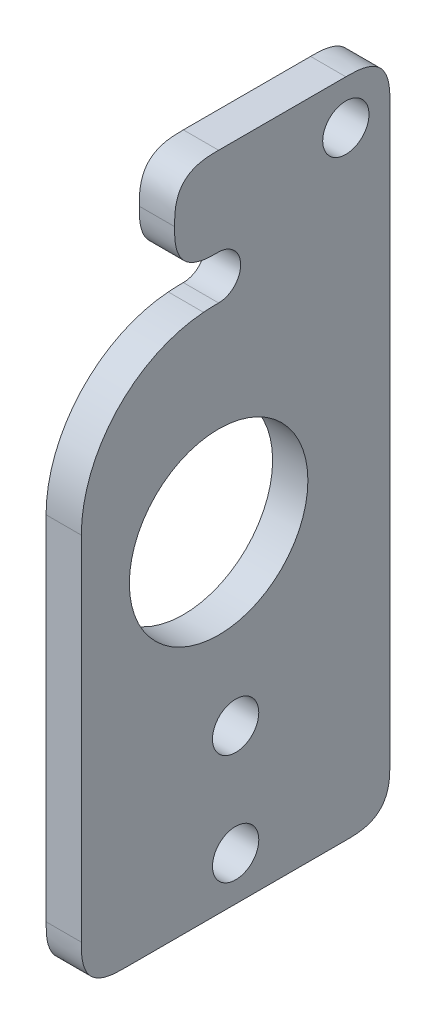
ISO-10303-21;
HEADER;
FILE_DESCRIPTION(('STEP AP214'),'2;1');
FILE_NAME('part.step','',(''),(''),'','','');
FILE_SCHEMA(('AUTOMOTIVE_DESIGN { 1 0 10303 214 1 1 1 1 }'));
ENDSEC;
DATA;
#1=APPLICATION_CONTEXT('core data for automotive mechanical design processes');
#2=APPLICATION_PROTOCOL_DEFINITION('international standard','automotive_design',2000,#1);
#3=PRODUCT_CONTEXT('',#1,'mechanical');
#4=PRODUCT('Part','Part','',(#3));
#5=PRODUCT_RELATED_PRODUCT_CATEGORY('part','',(#4));
#6=PRODUCT_DEFINITION_FORMATION('','',#4);
#7=PRODUCT_DEFINITION_CONTEXT('part definition',#1,'design');
#8=PRODUCT_DEFINITION('design','',#6,#7);
#9=PRODUCT_DEFINITION_SHAPE('','',#8);
#10=(LENGTH_UNIT() NAMED_UNIT(*) SI_UNIT(.MILLI.,.METRE.));
#11=(NAMED_UNIT(*) PLANE_ANGLE_UNIT() SI_UNIT($,.RADIAN.));
#12=(NAMED_UNIT(*) SI_UNIT($,.STERADIAN.) SOLID_ANGLE_UNIT());
#13=UNCERTAINTY_MEASURE_WITH_UNIT(LENGTH_MEASURE(1.E-05),#10,'distance_accuracy_value','');
#14=(GEOMETRIC_REPRESENTATION_CONTEXT(3) GLOBAL_UNCERTAINTY_ASSIGNED_CONTEXT((#13)) GLOBAL_UNIT_ASSIGNED_CONTEXT((#10,
#11,#12)) REPRESENTATION_CONTEXT('',''));
#15=CARTESIAN_POINT('',(0.,0.,0.));
#16=DIRECTION('',(0.,0.,1.));
#17=DIRECTION('',(1.,0.,0.));
#18=AXIS2_PLACEMENT_3D('',#15,#16,#17);
#19=CARTESIAN_POINT('',(-8.00000000000001,-75.0000000000001,-35.));
#20=DIRECTION('',(0.,0.,-1.));
#21=DIRECTION('',(-1.,0.,0.));
#22=AXIS2_PLACEMENT_3D('',#19,#20,#21);
#23=PLANE('',#22);
#24=DIRECTION('',(0.,1.,0.));
#25=VECTOR('',#24,1.);
#26=CARTESIAN_POINT('',(0.,-75.0000000000001,-35.));
#27=LINE('',#26,#25);
#28=CARTESIAN_POINT('',(0.,-65.0000000000001,-35.));
#29=VERTEX_POINT('',#28);
#30=CARTESIAN_POINT('',(0.,65.0000000000001,-35.));
#31=VERTEX_POINT('',#30);
#32=EDGE_CURVE('E393',#29,#31,#27,.T.);
#33=ORIENTED_EDGE('',*,*,#32,.F.);
#34=CARTESIAN_POINT('',(-8.40000000000002,-65.0000000000001,-35.));
#35=CARTESIAN_POINT('',(-5.4666666666689,-65.0000000000001,-35.));
#36=CARTESIAN_POINT('',(-2.53333333333333,-65.0000000000001,-35.));
#37=CARTESIAN_POINT('',(0.400000000000011,-65.0000000000001,-35.));
#38=B_SPLINE_CURVE_WITH_KNOTS('',3,(#34,#35,#36,#37),.UNSPECIFIED.,.F.,.F.,(4,4),(-0.0004,
0.0084),.UNSPECIFIED.);
#39=CARTESIAN_POINT('',(-8.00000000000001,-65.0000000000001,-35.));
#40=VERTEX_POINT('',#39);
#41=EDGE_CURVE('E547',#29,#40,#38,.F.);
#42=ORIENTED_EDGE('',*,*,#41,.T.);
#43=DIRECTION('',(0.,1.,0.));
#44=VECTOR('',#43,1.);
#45=CARTESIAN_POINT('',(-8.00000000000001,-75.0000000000001,-35.));
#46=LINE('',#45,#44);
#47=CARTESIAN_POINT('',(-8.00000000000001,65.0000000000001,-35.));
#48=VERTEX_POINT('',#47);
#49=EDGE_CURVE('E363',#40,#48,#46,.T.);
#50=ORIENTED_EDGE('',*,*,#49,.T.);
#51=CARTESIAN_POINT('',(0.400000000000011,65.0000000000001,-35.));
#52=CARTESIAN_POINT('',(-2.53333333333333,65.0000000000001,-35.));
#53=CARTESIAN_POINT('',(-5.4666666666689,65.0000000000001,-35.));
#54=CARTESIAN_POINT('',(-8.40000000000002,65.0000000000001,-35.));
#55=B_SPLINE_CURVE_WITH_KNOTS('',3,(#51,#52,#53,#54),.UNSPECIFIED.,.F.,.F.,(4,4),
(-0.000399999999999999,0.0084),.UNSPECIFIED.);
#56=EDGE_CURVE('E550',#48,#31,#55,.F.);
#57=ORIENTED_EDGE('',*,*,#56,.T.);
#58=EDGE_LOOP('',(#33,#42,#50,#57));
#59=FACE_BOUND('',#58,.T.);
#60=ADVANCED_FACE('F44',(#59),#23,.T.);
#61=CARTESIAN_POINT('',(-8.00000000000001,-75.0000000000001,35.));
#62=DIRECTION('',(0.,-1.,0.));
#63=DIRECTION('',(0.,0.,-1.));
#64=AXIS2_PLACEMENT_3D('',#61,#62,#63);
#65=PLANE('',#64);
#66=DIRECTION('',(0.,0.,-1.));
#67=VECTOR('',#66,1.);
#68=CARTESIAN_POINT('',(-8.00000000000001,-75.0000000000001,35.));
#69=LINE('',#68,#67);
#70=CARTESIAN_POINT('',(-8.00000000000001,-75.,25.));
#71=VERTEX_POINT('',#70);
#72=CARTESIAN_POINT('',(-8.00000000000001,-75.0000000000001,-25.));
#73=VERTEX_POINT('',#72);
#74=EDGE_CURVE('E365',#71,#73,#69,.T.);
#75=ORIENTED_EDGE('',*,*,#74,.T.);
#76=CARTESIAN_POINT('',(0.400000000000011,-75.0000000000001,-25.));
#77=CARTESIAN_POINT('',(-2.53333333333333,-75.0000000000001,-25.));
#78=CARTESIAN_POINT('',(-5.4666666666689,-75.0000000000001,-25.));
#79=CARTESIAN_POINT('',(-8.40000000000002,-75.0000000000001,-25.));
#80=B_SPLINE_CURVE_WITH_KNOTS('',3,(#76,#77,#78,#79),.UNSPECIFIED.,.F.,.F.,(4,4),
(-0.000399999999999999,0.0084),.UNSPECIFIED.);
#81=CARTESIAN_POINT('',(0.,-75.0000000000001,-25.));
#82=VERTEX_POINT('',#81);
#83=EDGE_CURVE('E331',#73,#82,#80,.F.);
#84=ORIENTED_EDGE('',*,*,#83,.T.);
#85=DIRECTION('',(0.,0.,-1.));
#86=VECTOR('',#85,1.);
#87=CARTESIAN_POINT('',(0.,-75.0000000000001,35.));
#88=LINE('',#87,#86);
#89=CARTESIAN_POINT('',(0.,-75.,25.));
#90=VERTEX_POINT('',#89);
#91=EDGE_CURVE('E359',#90,#82,#88,.T.);
#92=ORIENTED_EDGE('',*,*,#91,.F.);
#93=CARTESIAN_POINT('',(-8.40000000000002,-75.,25.));
#94=CARTESIAN_POINT('',(-5.4666666666689,-75.,25.));
#95=CARTESIAN_POINT('',(-2.53333333333333,-75.,25.));
#96=CARTESIAN_POINT('',(0.400000000000011,-75.,25.));
#97=B_SPLINE_CURVE_WITH_KNOTS('',3,(#93,#94,#95,#96),.UNSPECIFIED.,.F.,.F.,(4,4),(-0.0004,
0.0084),.UNSPECIFIED.);
#98=EDGE_CURVE('E339',#90,#71,#97,.F.);
#99=ORIENTED_EDGE('',*,*,#98,.T.);
#100=EDGE_LOOP('',(#75,#84,#92,#99));
#101=FACE_BOUND('',#100,.T.);
#102=ADVANCED_FACE('F422',(#101),#65,.T.);
#103=CARTESIAN_POINT('',(-8.00000000000001,-75.0000000000001,35.));
#104=DIRECTION('',(0.,0.,1.));
#105=DIRECTION('',(1.,0.,0.));
#106=AXIS2_PLACEMENT_3D('',#103,#104,#105);
#107=PLANE('',#106);
#108=DIRECTION('',(0.,-1.,0.));
#109=VECTOR('',#108,1.);
#110=CARTESIAN_POINT('',(-8.00000000000001,-75.0000000000001,35.));
#111=LINE('',#110,#109);
#112=CARTESIAN_POINT('',(-8.00000000000001,14.956617264609,35.));
#113=VERTEX_POINT('',#112);
#114=CARTESIAN_POINT('',(-8.00000000000001,-65.0000000000001,35.));
#115=VERTEX_POINT('',#114);
#116=EDGE_CURVE('E442',#113,#115,#111,.T.);
#117=ORIENTED_EDGE('',*,*,#116,.T.);
#118=CARTESIAN_POINT('',(0.400000000000011,-65.0000000000001,35.));
#119=CARTESIAN_POINT('',(-2.53333333333333,-65.0000000000001,35.));
#120=CARTESIAN_POINT('',(-5.4666666666689,-65.0000000000001,35.));
#121=CARTESIAN_POINT('',(-8.40000000000002,-65.0000000000001,35.));
#122=B_SPLINE_CURVE_WITH_KNOTS('',3,(#118,#119,#120,#121),.UNSPECIFIED.,.F.,.F.,(4,4),
(-0.000399999999999999,0.0084),.UNSPECIFIED.);
#123=CARTESIAN_POINT('',(0.,-65.0000000000001,35.));
#124=VERTEX_POINT('',#123);
#125=EDGE_CURVE('E11',#115,#124,#122,.F.);
#126=ORIENTED_EDGE('',*,*,#125,.T.);
#127=DIRECTION('',(0.,-1.,0.));
#128=VECTOR('',#127,1.);
#129=CARTESIAN_POINT('',(0.,-75.0000000000001,35.));
#130=LINE('',#129,#128);
#131=CARTESIAN_POINT('',(0.,14.956617264609,35.));
#132=VERTEX_POINT('',#131);
#133=EDGE_CURVE('E364',#132,#124,#130,.T.);
#134=ORIENTED_EDGE('',*,*,#133,.F.);
#135=DIRECTION('',(-1.,0.,0.));
#136=VECTOR('',#135,1.);
#137=CARTESIAN_POINT('',(-8.00000000000001,14.956617264609,35.));
#138=LINE('',#137,#136);
#139=EDGE_CURVE('E351',#132,#113,#138,.T.);
#140=ORIENTED_EDGE('',*,*,#139,.T.);
#141=EDGE_LOOP('',(#117,#126,#134,#140));
#142=FACE_BOUND('',#141,.T.);
#143=ADVANCED_FACE('F403',(#142),#107,.T.);
#144=CARTESIAN_POINT('',(-8.00000000000001,75.0000000000001,35.));
#145=DIRECTION('',(0.,1.,0.));
#146=DIRECTION('',(0.,0.,1.));
#147=AXIS2_PLACEMENT_3D('',#144,#145,#146);
#148=PLANE('',#147);
#149=DIRECTION('',(0.,0.,1.));
#150=VECTOR('',#149,1.);
#151=CARTESIAN_POINT('',(0.,75.0000000000001,35.));
#152=LINE('',#151,#150);
#153=CARTESIAN_POINT('',(0.,75.,-25.));
#154=VERTEX_POINT('',#153);
#155=CARTESIAN_POINT('',(0.,75.0000000000001,3.86));
#156=VERTEX_POINT('',#155);
#157=EDGE_CURVE('E406',#154,#156,#152,.T.);
#158=ORIENTED_EDGE('',*,*,#157,.F.);
#159=CARTESIAN_POINT('',(-8.39999999999996,75.,-25.));
#160=CARTESIAN_POINT('',(-5.4666666666689,75.,-25.));
#161=CARTESIAN_POINT('',(-2.53333333333333,75.,-25.));
#162=CARTESIAN_POINT('',(0.400000000000011,75.,-25.));
#163=B_SPLINE_CURVE_WITH_KNOTS('',3,(#159,#160,#161,#162),.UNSPECIFIED.,.F.,.F.,(4,4),(-0.0004,
0.0084),.UNSPECIFIED.);
#164=CARTESIAN_POINT('',(-8.00000000000001,75.,-25.));
#165=VERTEX_POINT('',#164);
#166=EDGE_CURVE('E59',#154,#165,#163,.F.);
#167=ORIENTED_EDGE('',*,*,#166,.T.);
#168=DIRECTION('',(0.,0.,1.));
#169=VECTOR('',#168,1.);
#170=CARTESIAN_POINT('',(-8.00000000000001,75.0000000000001,35.));
#171=LINE('',#170,#169);
#172=CARTESIAN_POINT('',(-8.00000000000001,75.0000000000001,3.86));
#173=VERTEX_POINT('',#172);
#174=EDGE_CURVE('E451',#165,#173,#171,.T.);
#175=ORIENTED_EDGE('',*,*,#174,.T.);
#176=CARTESIAN_POINT('',(0.400000000000011,75.0000000000001,3.86));
#177=CARTESIAN_POINT('',(-2.53333333333333,75.0000000000001,3.86));
#178=CARTESIAN_POINT('',(-5.46666666667145,75.0000000000001,3.86));
#179=CARTESIAN_POINT('',(-8.40000000000002,75.0000000000001,3.86));
#180=B_SPLINE_CURVE_WITH_KNOTS('',3,(#176,#177,#178,#179),.UNSPECIFIED.,.F.,.F.,(4,4),(-0.0084,
0.0004),.UNSPECIFIED.);
#181=EDGE_CURVE('E237',#173,#156,#180,.F.);
#182=ORIENTED_EDGE('',*,*,#181,.T.);
#183=EDGE_LOOP('',(#158,#167,#175,#182));
#184=FACE_BOUND('',#183,.T.);
#185=ADVANCED_FACE('F202',(#184),#148,.T.);
#186=CARTESIAN_POINT('',(-8.00000000000001,0.,0.));
#187=DIRECTION('',(-1.,0.,0.));
#188=DIRECTION('',(0.,0.,1.));
#189=AXIS2_PLACEMENT_3D('',#186,#187,#188);
#190=PLANE('',#189);
#191=CARTESIAN_POINT('',(-8.00000000000001,-40.,2.61861100413235E-13));
#192=DIRECTION('',(1.,0.,0.));
#193=DIRECTION('',(0.,0.,-1.));
#194=AXIS2_PLACEMENT_3D('',#191,#192,#193);
#195=CIRCLE('',#194,5.25);
#196=CARTESIAN_POINT('',(-8.00000000000001,-40.,-5.24999999999974));
#197=VERTEX_POINT('',#196);
#198=EDGE_CURVE('E377',#197,#197,#195,.T.);
#199=ORIENTED_EDGE('',*,*,#198,.T.);
#200=EDGE_LOOP('',(#199));
#201=FACE_BOUND('',#200,.T.);
#202=ORIENTED_EDGE('',*,*,#49,.F.);
#203=CARTESIAN_POINT('',(-8.00000000000002,-75.0000000000001,-25.));
#204=CARTESIAN_POINT('',(-8.00000000000002,-75.0000000000001,-26.6819805153395));
#205=CARTESIAN_POINT('',(-8.00000000000002,-75.0000000000001,-28.3639610306789));
#206=CARTESIAN_POINT('',(-8.00000000000002,-74.2830808016392,-32.0710678118655));
#207=CARTESIAN_POINT('',(-8.00000000000002,-72.0710678118655,-34.2830808016392));
#208=CARTESIAN_POINT('',(-8.00000000000002,-68.363961030679,-35.));
#209=CARTESIAN_POINT('',(-8.00000000000002,-66.6819805153395,-35.));
#210=CARTESIAN_POINT('',(-8.00000000000002,-65.0000000000001,-35.));
#211=B_SPLINE_CURVE_WITH_KNOTS('',5,(#203,#204,#205,#206,#207,#208,#209,#210),.UNSPECIFIED.,.F.,
.F.,(6,2,6),(0.,0.5,1.),.UNSPECIFIED.);
#212=EDGE_CURVE('E540',#40,#73,#211,.F.);
#213=ORIENTED_EDGE('',*,*,#212,.T.);
#214=ORIENTED_EDGE('',*,*,#74,.F.);
#215=CARTESIAN_POINT('',(-8.00000000000002,-65.0000000000001,35.));
#216=CARTESIAN_POINT('',(-8.00000000000002,-66.6819805153395,35.));
#217=CARTESIAN_POINT('',(-8.00000000000002,-68.363961030679,35.));
#218=CARTESIAN_POINT('',(-8.00000000000002,-72.0710678118655,34.2830808016392));
#219=CARTESIAN_POINT('',(-8.00000000000002,-74.2830808016392,32.0710678118655));
#220=CARTESIAN_POINT('',(-8.00000000000002,-75.0000000000001,28.3639610306789));
#221=CARTESIAN_POINT('',(-8.00000000000002,-75.0000000000001,26.6819805153395));
#222=CARTESIAN_POINT('',(-8.00000000000002,-75.,25.));
#223=B_SPLINE_CURVE_WITH_KNOTS('',5,(#215,#216,#217,#218,#219,#220,#221,#222),.UNSPECIFIED.,.F.,
.F.,(6,2,6),(0.,0.5,1.),.UNSPECIFIED.);
#224=EDGE_CURVE('E240',#71,#115,#223,.F.);
#225=ORIENTED_EDGE('',*,*,#224,.T.);
#226=ORIENTED_EDGE('',*,*,#116,.F.);
#227=CARTESIAN_POINT('',(-8.00000000000001,14.956617264609,5.));
#228=DIRECTION('',(-1.,0.,0.));
#229=DIRECTION('',(0.,0.,1.));
#230=AXIS2_PLACEMENT_3D('',#227,#228,#229);
#231=CIRCLE('',#230,30.);
#232=CARTESIAN_POINT('',(-8.00000000000001,44.869851793827,7.28000000000001));
#233=VERTEX_POINT('',#232);
#234=EDGE_CURVE('E150',#113,#233,#231,.T.);
#235=ORIENTED_EDGE('',*,*,#234,.T.);
#236=CARTESIAN_POINT('',(-8.00000000000001,0.,3.86));
#237=DIRECTION('',(-1.,0.,0.));
#238=DIRECTION('',(0.,0.,-1.));
#239=AXIS2_PLACEMENT_3D('',#236,#237,#238);
#240=CIRCLE('',#239,45.);
#241=CARTESIAN_POINT('',(-8.00000000000001,45.0000000000001,3.86));
#242=VERTEX_POINT('',#241);
#243=EDGE_CURVE('E141',#233,#242,#240,.T.);
#244=ORIENTED_EDGE('',*,*,#243,.T.);
#245=CARTESIAN_POINT('',(-8.00000000000001,50.0000000000001,3.86));
#246=DIRECTION('',(1.,0.,0.));
#247=DIRECTION('',(0.,0.,1.));
#248=AXIS2_PLACEMENT_3D('',#245,#246,#247);
#249=CIRCLE('',#248,5.);
#250=CARTESIAN_POINT('',(-8.00000000000001,55.0000000000001,3.86));
#251=VERTEX_POINT('',#250);
#252=EDGE_CURVE('E147',#242,#251,#249,.T.);
#253=ORIENTED_EDGE('',*,*,#252,.T.);
#254=CARTESIAN_POINT('',(-8.00000000000002,65.0000000000001,13.86));
#255=CARTESIAN_POINT('',(-8.00000000000002,63.3180194846606,13.86));
#256=CARTESIAN_POINT('',(-8.00000000000002,61.6360389693211,13.86));
#257=CARTESIAN_POINT('',(-8.00000000000002,57.9939620414461,13.1610673189576));
#258=CARTESIAN_POINT('',(-8.00000000000002,55.6698758623678,10.9781111478586));
#259=CARTESIAN_POINT('',(-8.00000000000002,54.9460404480447,7.02887147074437));
#260=CARTESIAN_POINT('',(-8.00000000000002,55.,5.40085050736019));
#261=CARTESIAN_POINT('',(-8.00000000000002,55.0000000000001,3.86));
#262=B_SPLINE_CURVE_WITH_KNOTS('',5,(#254,#255,#256,#257,#258,#259,#260,#261),.UNSPECIFIED.,.F.,
.F.,(6,2,6),(0.,0.5,1.),.UNSPECIFIED.);
#263=CARTESIAN_POINT('',(-8.00000000000001,65.0000000000001,13.86));
#264=VERTEX_POINT('',#263);
#265=EDGE_CURVE('E224',#251,#264,#262,.F.);
#266=ORIENTED_EDGE('',*,*,#265,.T.);
#267=CARTESIAN_POINT('',(-8.00000000000001,75.0000000000001,3.86));
#268=CARTESIAN_POINT('',(-8.00000000000001,75.,5.54198051533947));
#269=CARTESIAN_POINT('',(-8.00000000000001,75.,7.22396103067893));
#270=CARTESIAN_POINT('',(-8.00000000000001,74.2830808016392,10.9310678118655));
#271=CARTESIAN_POINT('',(-8.00000000000001,72.0710678118656,13.1430808016392));
#272=CARTESIAN_POINT('',(-8.00000000000001,68.363961030679,13.86));
#273=CARTESIAN_POINT('',(-8.00000000000001,66.6819805153395,13.86));
#274=CARTESIAN_POINT('',(-8.00000000000001,65.0000000000001,13.86));
#275=B_SPLINE_CURVE_WITH_KNOTS('',5,(#267,#268,#269,#270,#271,#272,#273,#274),.UNSPECIFIED.,.F.,
.F.,(6,2,6),(0.,0.5,1.),.UNSPECIFIED.);
#276=EDGE_CURVE('E66',#264,#173,#275,.F.);
#277=ORIENTED_EDGE('',*,*,#276,.T.);
#278=ORIENTED_EDGE('',*,*,#174,.F.);
#279=CARTESIAN_POINT('',(-8.00000000000002,65.0000000000001,-35.));
#280=CARTESIAN_POINT('',(-7.99999999999997,66.6819805153395,-35.));
#281=CARTESIAN_POINT('',(-7.99999999999997,68.363961030679,-35.));
#282=CARTESIAN_POINT('',(-7.99999999999997,72.0710678118655,-34.2830808016392));
#283=CARTESIAN_POINT('',(-7.99999999999997,74.2830808016392,-32.0710678118655));
#284=CARTESIAN_POINT('',(-7.99999999999997,75.0000000000001,-28.3639610306789));
#285=CARTESIAN_POINT('',(-7.99999999999997,75.0000000000001,-26.6819805153395));
#286=CARTESIAN_POINT('',(-7.99999999999997,75.,-25.));
#287=B_SPLINE_CURVE_WITH_KNOTS('',5,(#279,#280,#281,#282,#283,#284,#285,#286),.UNSPECIFIED.,.F.,
.F.,(6,2,6),(0.,0.5,1.),.UNSPECIFIED.);
#288=EDGE_CURVE('E186',#165,#48,#287,.F.);
#289=ORIENTED_EDGE('',*,*,#288,.T.);
#290=EDGE_LOOP('',(#202,#213,#214,#225,#226,#235,#244,#253,#266,#277,#278,#289));
#291=FACE_BOUND('',#290,.T.);
#292=CARTESIAN_POINT('',(-8.00000000000001,-65.0000000000001,0.));
#293=DIRECTION('',(1.,0.,0.));
#294=DIRECTION('',(0.,0.,-1.));
#295=AXIS2_PLACEMENT_3D('',#292,#293,#294);
#296=CIRCLE('',#295,5.25);
#297=CARTESIAN_POINT('',(-8.00000000000001,-65.0000000000001,-5.25));
#298=VERTEX_POINT('',#297);
#299=EDGE_CURVE('E155',#298,#298,#296,.T.);
#300=ORIENTED_EDGE('',*,*,#299,.T.);
#301=EDGE_LOOP('',(#300));
#302=FACE_BOUND('',#301,.T.);
#303=CARTESIAN_POINT('',(-8.00000000000001,0.,3.86));
#304=DIRECTION('',(1.,0.,0.));
#305=DIRECTION('',(0.,0.,-1.));
#306=AXIS2_PLACEMENT_3D('',#303,#304,#305);
#307=CIRCLE('',#306,20.25);
#308=CARTESIAN_POINT('',(-8.00000000000001,0.,-16.39));
#309=VERTEX_POINT('',#308);
#310=EDGE_CURVE('E522',#309,#309,#307,.T.);
#311=ORIENTED_EDGE('',*,*,#310,.T.);
#312=EDGE_LOOP('',(#311));
#313=FACE_BOUND('',#312,.T.);
#314=CARTESIAN_POINT('',(-8.00000000000001,65.,-25.));
#315=DIRECTION('',(1.,0.,0.));
#316=DIRECTION('',(0.,0.,-1.));
#317=AXIS2_PLACEMENT_3D('',#314,#315,#316);
#318=CIRCLE('',#317,5.25);
#319=CARTESIAN_POINT('',(-8.00000000000001,65.,-30.25));
#320=VERTEX_POINT('',#319);
#321=EDGE_CURVE('E248',#320,#320,#318,.T.);
#322=ORIENTED_EDGE('',*,*,#321,.T.);
#323=EDGE_LOOP('',(#322));
#324=FACE_BOUND('',#323,.T.);
#325=ADVANCED_FACE('F144',(#201,#291,#302,#313,#324),#190,.T.);
#326=CARTESIAN_POINT('',(0.,0.,0.));
#327=DIRECTION('',(-1.,0.,0.));
#328=DIRECTION('',(0.,0.,1.));
#329=AXIS2_PLACEMENT_3D('',#326,#327,#328);
#330=PLANE('',#329);
#331=CARTESIAN_POINT('',(0.,-40.,2.61861100413235E-13));
#332=DIRECTION('',(-1.,0.,0.));
#333=DIRECTION('',(0.,0.,1.));
#334=AXIS2_PLACEMENT_3D('',#331,#332,#333);
#335=CIRCLE('',#334,5.25);
#336=CARTESIAN_POINT('',(0.,-40.,5.25000000000026));
#337=VERTEX_POINT('',#336);
#338=EDGE_CURVE('E385',#337,#337,#335,.T.);
#339=ORIENTED_EDGE('',*,*,#338,.T.);
#340=EDGE_LOOP('',(#339));
#341=FACE_BOUND('',#340,.T.);
#342=CARTESIAN_POINT('',(0.,-65.0000000000001,0.));
#343=DIRECTION('',(-1.,0.,0.));
#344=DIRECTION('',(0.,0.,1.));
#345=AXIS2_PLACEMENT_3D('',#342,#343,#344);
#346=CIRCLE('',#345,5.25);
#347=CARTESIAN_POINT('',(0.,-65.0000000000001,5.25));
#348=VERTEX_POINT('',#347);
#349=EDGE_CURVE('E381',#348,#348,#346,.T.);
#350=ORIENTED_EDGE('',*,*,#349,.T.);
#351=EDGE_LOOP('',(#350));
#352=FACE_BOUND('',#351,.T.);
#353=CARTESIAN_POINT('',(0.,0.,3.86));
#354=DIRECTION('',(-1.,0.,0.));
#355=DIRECTION('',(0.,0.,1.));
#356=AXIS2_PLACEMENT_3D('',#353,#354,#355);
#357=CIRCLE('',#356,20.25);
#358=CARTESIAN_POINT('',(0.,0.,24.11));
#359=VERTEX_POINT('',#358);
#360=EDGE_CURVE('E376',#359,#359,#357,.T.);
#361=ORIENTED_EDGE('',*,*,#360,.T.);
#362=EDGE_LOOP('',(#361));
#363=FACE_BOUND('',#362,.T.);
#364=CARTESIAN_POINT('',(0.,65.,-25.));
#365=DIRECTION('',(-1.,0.,0.));
#366=DIRECTION('',(0.,0.,1.));
#367=AXIS2_PLACEMENT_3D('',#364,#365,#366);
#368=CIRCLE('',#367,5.25);
#369=CARTESIAN_POINT('',(0.,65.,-19.75));
#370=VERTEX_POINT('',#369);
#371=EDGE_CURVE('E372',#370,#370,#368,.T.);
#372=ORIENTED_EDGE('',*,*,#371,.T.);
#373=EDGE_LOOP('',(#372));
#374=FACE_BOUND('',#373,.T.);
#375=ORIENTED_EDGE('',*,*,#91,.T.);
#376=CARTESIAN_POINT('',(0.,-65.0000000000001,-35.));
#377=CARTESIAN_POINT('',(0.,-66.6819805153395,-35.));
#378=CARTESIAN_POINT('',(0.,-68.363961030679,-35.));
#379=CARTESIAN_POINT('',(0.,-72.0710678118655,-34.2830808016392));
#380=CARTESIAN_POINT('',(0.,-74.2830808016392,-32.0710678118655));
#381=CARTESIAN_POINT('',(0.,-75.0000000000001,-28.3639610306789));
#382=CARTESIAN_POINT('',(0.,-75.0000000000001,-26.6819805153395));
#383=CARTESIAN_POINT('',(0.,-75.0000000000001,-25.));
#384=B_SPLINE_CURVE_WITH_KNOTS('',5,(#376,#377,#378,#379,#380,#381,#382,#383),.UNSPECIFIED.,.F.,
.F.,(6,2,6),(0.,0.5,1.),.UNSPECIFIED.);
#385=EDGE_CURVE('E506',#82,#29,#384,.F.);
#386=ORIENTED_EDGE('',*,*,#385,.T.);
#387=ORIENTED_EDGE('',*,*,#32,.T.);
#388=CARTESIAN_POINT('',(0.,75.,-25.));
#389=CARTESIAN_POINT('',(0.,75.0000000000001,-26.6819805153395));
#390=CARTESIAN_POINT('',(0.,75.0000000000001,-28.3639610306789));
#391=CARTESIAN_POINT('',(0.,74.2830808016392,-32.0710678118655));
#392=CARTESIAN_POINT('',(0.,72.0710678118655,-34.2830808016392));
#393=CARTESIAN_POINT('',(0.,68.363961030679,-35.));
#394=CARTESIAN_POINT('',(0.,66.6819805153395,-35.));
#395=CARTESIAN_POINT('',(0.,65.0000000000001,-35.));
#396=B_SPLINE_CURVE_WITH_KNOTS('',5,(#388,#389,#390,#391,#392,#393,#394,#395),.UNSPECIFIED.,.F.,
.F.,(6,2,6),(0.,0.5,1.),.UNSPECIFIED.);
#397=EDGE_CURVE('E329',#31,#154,#396,.F.);
#398=ORIENTED_EDGE('',*,*,#397,.T.);
#399=ORIENTED_EDGE('',*,*,#157,.T.);
#400=CARTESIAN_POINT('',(0.,65.0000000000001,13.86));
#401=CARTESIAN_POINT('',(0.,66.6819805153395,13.86));
#402=CARTESIAN_POINT('',(0.,68.363961030679,13.86));
#403=CARTESIAN_POINT('',(0.,72.0710678118656,13.1430808016392));
#404=CARTESIAN_POINT('',(0.,74.2830808016392,10.9310678118655));
#405=CARTESIAN_POINT('',(0.,75.,7.22396103067893));
#406=CARTESIAN_POINT('',(0.,75.,5.54198051533947));
#407=CARTESIAN_POINT('',(0.,75.0000000000001,3.86));
#408=B_SPLINE_CURVE_WITH_KNOTS('',5,(#400,#401,#402,#403,#404,#405,#406,#407),.UNSPECIFIED.,.F.,
.F.,(6,2,6),(0.,0.5,1.),.UNSPECIFIED.);
#409=CARTESIAN_POINT('',(0.,65.0000000000001,13.86));
#410=VERTEX_POINT('',#409);
#411=EDGE_CURVE('E307',#156,#410,#408,.F.);
#412=ORIENTED_EDGE('',*,*,#411,.T.);
#413=CARTESIAN_POINT('',(0.,55.0000000000001,3.86));
#414=CARTESIAN_POINT('',(0.,55.,5.40085050736019));
#415=CARTESIAN_POINT('',(0.,54.9460404480447,7.02887147074437));
#416=CARTESIAN_POINT('',(0.,55.6698758623678,10.9781111478586));
#417=CARTESIAN_POINT('',(0.,57.9939620414461,13.1610673189576));
#418=CARTESIAN_POINT('',(0.,61.6360389693211,13.86));
#419=CARTESIAN_POINT('',(0.,63.3180194846606,13.86));
#420=CARTESIAN_POINT('',(0.,65.0000000000001,13.86));
#421=B_SPLINE_CURVE_WITH_KNOTS('',5,(#413,#414,#415,#416,#417,#418,#419,#420),.UNSPECIFIED.,.F.,
.F.,(6,2,6),(0.,0.5,1.),.UNSPECIFIED.);
#422=CARTESIAN_POINT('',(0.,55.0000000000001,3.86));
#423=VERTEX_POINT('',#422);
#424=EDGE_CURVE('E245',#410,#423,#421,.F.);
#425=ORIENTED_EDGE('',*,*,#424,.T.);
#426=CARTESIAN_POINT('',(0.,50.0000000000001,3.86));
#427=DIRECTION('',(-1.,0.,0.));
#428=DIRECTION('',(0.,0.,1.));
#429=AXIS2_PLACEMENT_3D('',#426,#427,#428);
#430=CIRCLE('',#429,5.);
#431=CARTESIAN_POINT('',(0.,45.0000000000001,3.86));
#432=VERTEX_POINT('',#431);
#433=EDGE_CURVE('E389',#423,#432,#430,.T.);
#434=ORIENTED_EDGE('',*,*,#433,.T.);
#435=CARTESIAN_POINT('',(0.,0.,3.86));
#436=DIRECTION('',(-1.,0.,0.));
#437=DIRECTION('',(0.,0.,1.));
#438=AXIS2_PLACEMENT_3D('',#435,#436,#437);
#439=CIRCLE('',#438,45.);
#440=CARTESIAN_POINT('',(0.,44.869851793827,7.28000000000001));
#441=VERTEX_POINT('',#440);
#442=EDGE_CURVE('E161',#432,#441,#439,.F.);
#443=ORIENTED_EDGE('',*,*,#442,.T.);
#444=CARTESIAN_POINT('',(0.,14.956617264609,5.));
#445=DIRECTION('',(-1.,0.,0.));
#446=DIRECTION('',(0.,0.,1.));
#447=AXIS2_PLACEMENT_3D('',#444,#445,#446);
#448=CIRCLE('',#447,30.);
#449=EDGE_CURVE('E355',#441,#132,#448,.F.);
#450=ORIENTED_EDGE('',*,*,#449,.T.);
#451=ORIENTED_EDGE('',*,*,#133,.T.);
#452=CARTESIAN_POINT('',(0.,-75.,25.));
#453=CARTESIAN_POINT('',(0.,-75.0000000000001,26.6819805153395));
#454=CARTESIAN_POINT('',(0.,-75.0000000000001,28.3639610306789));
#455=CARTESIAN_POINT('',(0.,-74.2830808016392,32.0710678118655));
#456=CARTESIAN_POINT('',(0.,-72.0710678118655,34.2830808016392));
#457=CARTESIAN_POINT('',(0.,-68.363961030679,35.));
#458=CARTESIAN_POINT('',(0.,-66.6819805153395,35.));
#459=CARTESIAN_POINT('',(0.,-65.0000000000001,35.));
#460=B_SPLINE_CURVE_WITH_KNOTS('',5,(#452,#453,#454,#455,#456,#457,#458,#459),.UNSPECIFIED.,.F.,
.F.,(6,2,6),(0.,0.5,1.),.UNSPECIFIED.);
#461=EDGE_CURVE('E326',#124,#90,#460,.F.);
#462=ORIENTED_EDGE('',*,*,#461,.T.);
#463=EDGE_LOOP('',(#375,#386,#387,#398,#399,#412,#425,#434,#443,#450,#451,#462));
#464=FACE_BOUND('',#463,.T.);
#465=ADVANCED_FACE('F201',(#341,#352,#363,#374,#464),#330,.F.);
#466=CARTESIAN_POINT('',(-8.00000000000001,65.,-25.));
#467=DIRECTION('',(1.,0.,0.));
#468=DIRECTION('',(0.,0.,-1.));
#469=AXIS2_PLACEMENT_3D('',#466,#467,#468);
#470=CYLINDRICAL_SURFACE('',#469,5.25);
#471=ORIENTED_EDGE('',*,*,#321,.F.);
#472=EDGE_LOOP('',(#471));
#473=FACE_BOUND('',#472,.T.);
#474=ORIENTED_EDGE('',*,*,#371,.F.);
#475=EDGE_LOOP('',(#474));
#476=FACE_BOUND('',#475,.T.);
#477=ADVANCED_FACE('F204',(#473,#476),#470,.F.);
#478=CARTESIAN_POINT('',(-8.00000000000001,0.,3.86));
#479=DIRECTION('',(1.,0.,0.));
#480=DIRECTION('',(0.,0.,-1.));
#481=AXIS2_PLACEMENT_3D('',#478,#479,#480);
#482=CYLINDRICAL_SURFACE('',#481,20.25);
#483=ORIENTED_EDGE('',*,*,#310,.F.);
#484=EDGE_LOOP('',(#483));
#485=FACE_BOUND('',#484,.T.);
#486=ORIENTED_EDGE('',*,*,#360,.F.);
#487=EDGE_LOOP('',(#486));
#488=FACE_BOUND('',#487,.T.);
#489=ADVANCED_FACE('F686',(#485,#488),#482,.F.);
#490=CARTESIAN_POINT('',(-8.00000000000001,-65.0000000000001,0.));
#491=DIRECTION('',(1.,0.,0.));
#492=DIRECTION('',(0.,0.,-1.));
#493=AXIS2_PLACEMENT_3D('',#490,#491,#492);
#494=CYLINDRICAL_SURFACE('',#493,5.25);
#495=ORIENTED_EDGE('',*,*,#299,.F.);
#496=EDGE_LOOP('',(#495));
#497=FACE_BOUND('',#496,.T.);
#498=ORIENTED_EDGE('',*,*,#349,.F.);
#499=EDGE_LOOP('',(#498));
#500=FACE_BOUND('',#499,.T.);
#501=ADVANCED_FACE('F684',(#497,#500),#494,.F.);
#502=CARTESIAN_POINT('',(-8.00000000000001,0.,3.86));
#503=DIRECTION('',(1.,0.,0.));
#504=DIRECTION('',(0.,0.,-1.));
#505=AXIS2_PLACEMENT_3D('',#502,#503,#504);
#506=CYLINDRICAL_SURFACE('',#505,45.);
#507=ORIENTED_EDGE('',*,*,#243,.F.);
#508=DIRECTION('',(1.,0.,0.));
#509=VECTOR('',#508,1.);
#510=CARTESIAN_POINT('',(-8.00000000000001,44.869851793827,7.28000000000001));
#511=LINE('',#510,#509);
#512=EDGE_CURVE('E388',#233,#441,#511,.T.);
#513=ORIENTED_EDGE('',*,*,#512,.T.);
#514=ORIENTED_EDGE('',*,*,#442,.F.);
#515=DIRECTION('',(1.,0.,0.));
#516=VECTOR('',#515,1.);
#517=CARTESIAN_POINT('',(-8.00000000000001,45.0000000000001,3.86));
#518=LINE('',#517,#516);
#519=EDGE_CURVE('E158',#242,#432,#518,.T.);
#520=ORIENTED_EDGE('',*,*,#519,.F.);
#521=EDGE_LOOP('',(#507,#513,#514,#520));
#522=FACE_BOUND('',#521,.T.);
#523=ADVANCED_FACE('F159',(#522),#506,.T.);
#524=CARTESIAN_POINT('',(-8.00000000000001,50.0000000000001,3.86));
#525=DIRECTION('',(1.,0.,0.));
#526=DIRECTION('',(0.,0.,-1.));
#527=AXIS2_PLACEMENT_3D('',#524,#525,#526);
#528=CYLINDRICAL_SURFACE('',#527,5.);
#529=CARTESIAN_POINT('',(-8.40000000000002,55.0000000000001,3.86));
#530=CARTESIAN_POINT('',(-5.4666666666689,55.0000000000001,3.86));
#531=CARTESIAN_POINT('',(-2.53333333333333,55.0000000000001,3.86));
#532=CARTESIAN_POINT('',(0.400000000000011,55.0000000000001,3.86));
#533=B_SPLINE_CURVE_WITH_KNOTS('',3,(#529,#530,#531,#532),.UNSPECIFIED.,.F.,.F.,(4,4),(-0.0004,
0.0084),.UNSPECIFIED.);
#534=EDGE_CURVE('E166',#251,#423,#533,.T.);
#535=ORIENTED_EDGE('',*,*,#534,.F.);
#536=ORIENTED_EDGE('',*,*,#252,.F.);
#537=ORIENTED_EDGE('',*,*,#519,.T.);
#538=ORIENTED_EDGE('',*,*,#433,.F.);
#539=EDGE_LOOP('',(#535,#536,#537,#538));
#540=FACE_BOUND('',#539,.T.);
#541=ADVANCED_FACE('F169',(#540),#528,.F.);
#542=CARTESIAN_POINT('',(-8.00000000000001,-40.,2.61861100413235E-13));
#543=DIRECTION('',(1.,0.,0.));
#544=DIRECTION('',(0.,0.,-1.));
#545=AXIS2_PLACEMENT_3D('',#542,#543,#544);
#546=CYLINDRICAL_SURFACE('',#545,5.25);
#547=ORIENTED_EDGE('',*,*,#198,.F.);
#548=EDGE_LOOP('',(#547));
#549=FACE_BOUND('',#548,.T.);
#550=ORIENTED_EDGE('',*,*,#338,.F.);
#551=EDGE_LOOP('',(#550));
#552=FACE_BOUND('',#551,.T.);
#553=ADVANCED_FACE('F411',(#549,#552),#546,.F.);
#554=CARTESIAN_POINT('',(-8.00000000000001,14.956617264609,5.));
#555=DIRECTION('',(1.,0.,0.));
#556=DIRECTION('',(0.,0.,-1.));
#557=AXIS2_PLACEMENT_3D('',#554,#555,#556);
#558=CYLINDRICAL_SURFACE('',#557,30.);
#559=ORIENTED_EDGE('',*,*,#234,.F.);
#560=ORIENTED_EDGE('',*,*,#139,.F.);
#561=ORIENTED_EDGE('',*,*,#449,.F.);
#562=ORIENTED_EDGE('',*,*,#512,.F.);
#563=EDGE_LOOP('',(#559,#560,#561,#562));
#564=FACE_BOUND('',#563,.T.);
#565=ADVANCED_FACE('F408',(#564),#558,.T.);
#566=CARTESIAN_POINT('',(-8.40000000000002,-75.0000000000001,-25.));
#567=CARTESIAN_POINT('',(-5.4666666666689,-75.0000000000001,-25.));
#568=CARTESIAN_POINT('',(-2.53333333333333,-75.0000000000001,-25.));
#569=CARTESIAN_POINT('',(0.400000000000011,-75.0000000000001,-25.));
#570=CARTESIAN_POINT('',(-8.40000000000002,-75.0000000000001,-26.6819805153395));
#571=CARTESIAN_POINT('',(-5.4666666666689,-75.0000000000001,-26.6819805153395));
#572=CARTESIAN_POINT('',(-2.53333333333333,-75.0000000000001,-26.6819805153395));
#573=CARTESIAN_POINT('',(0.400000000000011,-75.0000000000001,-26.6819805153395));
#574=CARTESIAN_POINT('',(-8.40000000000002,-75.0000000000001,-28.3639610306789));
#575=CARTESIAN_POINT('',(-5.4666666666689,-75.0000000000001,-28.3639610306789));
#576=CARTESIAN_POINT('',(-2.53333333333333,-75.0000000000001,-28.3639610306789));
#577=CARTESIAN_POINT('',(0.400000000000011,-75.0000000000001,-28.3639610306789));
#578=CARTESIAN_POINT('',(-8.40000000000002,-74.2830808016392,-32.0710678118655));
#579=CARTESIAN_POINT('',(-5.4666666666689,-74.2830808016392,-32.0710678118655));
#580=CARTESIAN_POINT('',(-2.53333333333333,-74.2830808016392,-32.0710678118655));
#581=CARTESIAN_POINT('',(0.400000000000011,-74.2830808016392,-32.0710678118655));
#582=CARTESIAN_POINT('',(-8.40000000000002,-72.0710678118655,-34.2830808016392));
#583=CARTESIAN_POINT('',(-5.4666666666689,-72.0710678118655,-34.2830808016392));
#584=CARTESIAN_POINT('',(-2.53333333333333,-72.0710678118655,-34.2830808016392));
#585=CARTESIAN_POINT('',(0.400000000000011,-72.0710678118655,-34.2830808016392));
#586=CARTESIAN_POINT('',(-8.40000000000002,-68.363961030679,-35.));
#587=CARTESIAN_POINT('',(-5.4666666666689,-68.363961030679,-35.));
#588=CARTESIAN_POINT('',(-2.53333333333333,-68.363961030679,-35.));
#589=CARTESIAN_POINT('',(0.400000000000011,-68.363961030679,-35.));
#590=CARTESIAN_POINT('',(-8.40000000000002,-66.6819805153395,-35.));
#591=CARTESIAN_POINT('',(-5.4666666666689,-66.6819805153395,-35.));
#592=CARTESIAN_POINT('',(-2.53333333333333,-66.6819805153395,-35.));
#593=CARTESIAN_POINT('',(0.400000000000011,-66.6819805153395,-35.));
#594=CARTESIAN_POINT('',(-8.40000000000002,-65.0000000000001,-35.));
#595=CARTESIAN_POINT('',(-5.4666666666689,-65.0000000000001,-35.));
#596=CARTESIAN_POINT('',(-2.53333333333333,-65.0000000000001,-35.));
#597=CARTESIAN_POINT('',(0.400000000000011,-65.0000000000001,-35.));
#598=B_SPLINE_SURFACE_WITH_KNOTS('',5,3,((#566,#567,#568,#569),(#570,#571,#572,#573),(#574,#575,
#576,#577),(#578,#579,#580,#581),(#582,#583,#584,#585),(#586,#587,#588,#589),(#590,#591,#592,
#593),(#594,#595,#596,#597)),.UNSPECIFIED.,.F.,.F.,.F.,(6,2,6),(4,4),(0.,0.5,1.),(-0.0004,
0.0084),.UNSPECIFIED.);
#599=ORIENTED_EDGE('',*,*,#212,.F.);
#600=ORIENTED_EDGE('',*,*,#41,.F.);
#601=ORIENTED_EDGE('',*,*,#385,.F.);
#602=ORIENTED_EDGE('',*,*,#83,.F.);
#603=EDGE_LOOP('',(#599,#600,#601,#602));
#604=FACE_BOUND('',#603,.T.);
#605=ADVANCED_FACE('F410',(#604),#598,.T.);
#606=CARTESIAN_POINT('',(-8.40000000000002,65.0000000000001,-35.));
#607=CARTESIAN_POINT('',(-5.4666666666689,65.0000000000001,-35.));
#608=CARTESIAN_POINT('',(-2.53333333333333,65.0000000000001,-35.));
#609=CARTESIAN_POINT('',(0.400000000000011,65.0000000000001,-35.));
#610=CARTESIAN_POINT('',(-8.39999999999996,66.6819805153395,-35.));
#611=CARTESIAN_POINT('',(-5.4666666666689,66.6819805153395,-35.));
#612=CARTESIAN_POINT('',(-2.53333333333333,66.6819805153395,-35.));
#613=CARTESIAN_POINT('',(0.400000000000011,66.6819805153395,-35.));
#614=CARTESIAN_POINT('',(-8.39999999999996,68.363961030679,-35.));
#615=CARTESIAN_POINT('',(-5.4666666666689,68.363961030679,-35.));
#616=CARTESIAN_POINT('',(-2.53333333333333,68.363961030679,-35.));
#617=CARTESIAN_POINT('',(0.400000000000011,68.363961030679,-35.));
#618=CARTESIAN_POINT('',(-8.39999999999996,72.0710678118655,-34.2830808016392));
#619=CARTESIAN_POINT('',(-5.4666666666689,72.0710678118655,-34.2830808016392));
#620=CARTESIAN_POINT('',(-2.53333333333333,72.0710678118655,-34.2830808016392));
#621=CARTESIAN_POINT('',(0.400000000000011,72.0710678118655,-34.2830808016392));
#622=CARTESIAN_POINT('',(-8.39999999999996,74.2830808016392,-32.0710678118655));
#623=CARTESIAN_POINT('',(-5.4666666666689,74.2830808016392,-32.0710678118655));
#624=CARTESIAN_POINT('',(-2.53333333333333,74.2830808016392,-32.0710678118655));
#625=CARTESIAN_POINT('',(0.400000000000011,74.2830808016392,-32.0710678118655));
#626=CARTESIAN_POINT('',(-8.39999999999996,75.0000000000001,-28.3639610306789));
#627=CARTESIAN_POINT('',(-5.4666666666689,75.0000000000001,-28.3639610306789));
#628=CARTESIAN_POINT('',(-2.53333333333333,75.0000000000001,-28.3639610306789));
#629=CARTESIAN_POINT('',(0.400000000000011,75.0000000000001,-28.3639610306789));
#630=CARTESIAN_POINT('',(-8.39999999999996,75.0000000000001,-26.6819805153395));
#631=CARTESIAN_POINT('',(-5.4666666666689,75.0000000000001,-26.6819805153395));
#632=CARTESIAN_POINT('',(-2.53333333333333,75.0000000000001,-26.6819805153395));
#633=CARTESIAN_POINT('',(0.400000000000011,75.0000000000001,-26.6819805153395));
#634=CARTESIAN_POINT('',(-8.39999999999996,75.,-25.));
#635=CARTESIAN_POINT('',(-5.4666666666689,75.,-25.));
#636=CARTESIAN_POINT('',(-2.53333333333333,75.,-25.));
#637=CARTESIAN_POINT('',(0.400000000000011,75.,-25.));
#638=B_SPLINE_SURFACE_WITH_KNOTS('',5,3,((#606,#607,#608,#609),(#610,#611,#612,#613),(#614,#615,
#616,#617),(#618,#619,#620,#621),(#622,#623,#624,#625),(#626,#627,#628,#629),(#630,#631,#632,
#633),(#634,#635,#636,#637)),.UNSPECIFIED.,.F.,.F.,.F.,(6,2,6),(4,4),(0.,0.5,1.),(-0.0004,
0.0084),.UNSPECIFIED.);
#639=ORIENTED_EDGE('',*,*,#288,.F.);
#640=ORIENTED_EDGE('',*,*,#166,.F.);
#641=ORIENTED_EDGE('',*,*,#397,.F.);
#642=ORIENTED_EDGE('',*,*,#56,.F.);
#643=EDGE_LOOP('',(#639,#640,#641,#642));
#644=FACE_BOUND('',#643,.T.);
#645=ADVANCED_FACE('F272',(#644),#638,.T.);
#646=CARTESIAN_POINT('',(0.400000000000011,65.0000000000001,13.86));
#647=CARTESIAN_POINT('',(-2.53333333333333,65.0000000000001,13.86));
#648=CARTESIAN_POINT('',(-5.46666666667145,65.0000000000001,13.86));
#649=CARTESIAN_POINT('',(-8.40000000000002,65.0000000000001,13.86));
#650=CARTESIAN_POINT('',(0.400000000000011,66.6819805153395,13.86));
#651=CARTESIAN_POINT('',(-2.53333333333333,66.6819805153395,13.86));
#652=CARTESIAN_POINT('',(-5.46666666667145,66.6819805153395,13.86));
#653=CARTESIAN_POINT('',(-8.40000000000002,66.6819805153395,13.86));
#654=CARTESIAN_POINT('',(0.400000000000011,68.363961030679,13.86));
#655=CARTESIAN_POINT('',(-2.53333333333333,68.363961030679,13.86));
#656=CARTESIAN_POINT('',(-5.46666666667145,68.363961030679,13.86));
#657=CARTESIAN_POINT('',(-8.40000000000002,68.363961030679,13.86));
#658=CARTESIAN_POINT('',(0.400000000000011,72.0710678118656,13.1430808016392));
#659=CARTESIAN_POINT('',(-2.53333333333333,72.0710678118656,13.1430808016392));
#660=CARTESIAN_POINT('',(-5.46666666667145,72.0710678118656,13.1430808016392));
#661=CARTESIAN_POINT('',(-8.40000000000002,72.0710678118656,13.1430808016392));
#662=CARTESIAN_POINT('',(0.400000000000011,74.2830808016392,10.9310678118655));
#663=CARTESIAN_POINT('',(-2.53333333333333,74.2830808016392,10.9310678118655));
#664=CARTESIAN_POINT('',(-5.46666666667145,74.2830808016392,10.9310678118655));
#665=CARTESIAN_POINT('',(-8.40000000000002,74.2830808016392,10.9310678118655));
#666=CARTESIAN_POINT('',(0.400000000000011,75.,7.22396103067893));
#667=CARTESIAN_POINT('',(-2.53333333333333,75.,7.22396103067893));
#668=CARTESIAN_POINT('',(-5.46666666667145,75.,7.22396103067893));
#669=CARTESIAN_POINT('',(-8.40000000000002,75.,7.22396103067893));
#670=CARTESIAN_POINT('',(0.400000000000011,75.,5.54198051533947));
#671=CARTESIAN_POINT('',(-2.53333333333333,75.,5.54198051533947));
#672=CARTESIAN_POINT('',(-5.46666666667145,75.,5.54198051533947));
#673=CARTESIAN_POINT('',(-8.40000000000002,75.,5.54198051533947));
#674=CARTESIAN_POINT('',(0.400000000000011,75.0000000000001,3.86));
#675=CARTESIAN_POINT('',(-2.53333333333333,75.0000000000001,3.86));
#676=CARTESIAN_POINT('',(-5.46666666667145,75.0000000000001,3.86));
#677=CARTESIAN_POINT('',(-8.40000000000002,75.0000000000001,3.86));
#678=B_SPLINE_SURFACE_WITH_KNOTS('',5,3,((#646,#647,#648,#649),(#650,#651,#652,#653),(#654,#655,
#656,#657),(#658,#659,#660,#661),(#662,#663,#664,#665),(#666,#667,#668,#669),(#670,#671,#672,
#673),(#674,#675,#676,#677)),.UNSPECIFIED.,.F.,.F.,.F.,(6,2,6),(4,4),(0.,0.5,1.),(-0.0084,
0.0004),.UNSPECIFIED.);
#679=CARTESIAN_POINT('',(0.400000000000011,65.0000000000001,13.86));
#680=CARTESIAN_POINT('',(-2.53333333333333,65.0000000000001,13.86));
#681=CARTESIAN_POINT('',(-5.4666666666689,65.0000000000001,13.86));
#682=CARTESIAN_POINT('',(-8.40000000000002,65.0000000000001,13.86));
#683=B_SPLINE_CURVE_WITH_KNOTS('',3,(#679,#680,#681,#682),.UNSPECIFIED.,.F.,.F.,(4,4),
(-0.000399999999999999,0.0084),.UNSPECIFIED.);
#684=EDGE_CURVE('E234',#410,#264,#683,.T.);
#685=ORIENTED_EDGE('',*,*,#181,.F.);
#686=ORIENTED_EDGE('',*,*,#276,.F.);
#687=ORIENTED_EDGE('',*,*,#684,.F.);
#688=ORIENTED_EDGE('',*,*,#411,.F.);
#689=EDGE_LOOP('',(#685,#686,#687,#688));
#690=FACE_BOUND('',#689,.T.);
#691=ADVANCED_FACE('F232',(#690),#678,.T.);
#692=CARTESIAN_POINT('',(-8.40000000000002,65.0000000000001,13.86));
#693=CARTESIAN_POINT('',(-5.4666666666689,65.0000000000001,13.86));
#694=CARTESIAN_POINT('',(-2.53333333333333,65.0000000000001,13.86));
#695=CARTESIAN_POINT('',(0.400000000000011,65.0000000000001,13.86));
#696=CARTESIAN_POINT('',(-8.40000000000002,63.3180194846606,13.86));
#697=CARTESIAN_POINT('',(-5.4666666666689,63.3180194846606,13.86));
#698=CARTESIAN_POINT('',(-2.53333333333333,63.3180194846606,13.86));
#699=CARTESIAN_POINT('',(0.400000000000011,63.3180194846606,13.86));
#700=CARTESIAN_POINT('',(-8.40000000000002,61.6360389693211,13.86));
#701=CARTESIAN_POINT('',(-5.4666666666689,61.6360389693211,13.86));
#702=CARTESIAN_POINT('',(-2.53333333333333,61.6360389693211,13.86));
#703=CARTESIAN_POINT('',(0.400000000000011,61.6360389693211,13.86));
#704=CARTESIAN_POINT('',(-8.40000000000002,57.9939620414461,13.1610673189576));
#705=CARTESIAN_POINT('',(-5.4666666666689,57.9939620414461,13.1610673189576));
#706=CARTESIAN_POINT('',(-2.53333333333333,57.9939620414461,13.1610673189576));
#707=CARTESIAN_POINT('',(0.400000000000011,57.9939620414461,13.1610673189576));
#708=CARTESIAN_POINT('',(-8.40000000000002,55.6698758623678,10.9781111478586));
#709=CARTESIAN_POINT('',(-5.4666666666689,55.6698758623678,10.9781111478586));
#710=CARTESIAN_POINT('',(-2.53333333333333,55.6698758623678,10.9781111478586));
#711=CARTESIAN_POINT('',(0.400000000000011,55.6698758623678,10.9781111478586));
#712=CARTESIAN_POINT('',(-8.40000000000002,54.9460404480447,7.02887147074437));
#713=CARTESIAN_POINT('',(-5.4666666666689,54.9460404480447,7.02887147074437));
#714=CARTESIAN_POINT('',(-2.53333333333333,54.9460404480447,7.02887147074437));
#715=CARTESIAN_POINT('',(0.400000000000011,54.9460404480447,7.02887147074437));
#716=CARTESIAN_POINT('',(-8.40000000000002,55.,5.40085050736019));
#717=CARTESIAN_POINT('',(-5.4666666666689,55.,5.40085050736019));
#718=CARTESIAN_POINT('',(-2.53333333333333,55.,5.40085050736019));
#719=CARTESIAN_POINT('',(0.400000000000011,55.,5.40085050736019));
#720=CARTESIAN_POINT('',(-8.40000000000002,55.0000000000001,3.86));
#721=CARTESIAN_POINT('',(-5.4666666666689,55.0000000000001,3.86));
#722=CARTESIAN_POINT('',(-2.53333333333333,55.0000000000001,3.86));
#723=CARTESIAN_POINT('',(0.400000000000011,55.0000000000001,3.86));
#724=B_SPLINE_SURFACE_WITH_KNOTS('',5,3,((#692,#693,#694,#695),(#696,#697,#698,#699),(#700,#701,
#702,#703),(#704,#705,#706,#707),(#708,#709,#710,#711),(#712,#713,#714,#715),(#716,#717,#718,
#719),(#720,#721,#722,#723)),.UNSPECIFIED.,.F.,.F.,.F.,(6,2,6),(4,4),(0.,0.5,1.),(-0.0004,
0.0084),.UNSPECIFIED.);
#725=ORIENTED_EDGE('',*,*,#265,.F.);
#726=ORIENTED_EDGE('',*,*,#534,.T.);
#727=ORIENTED_EDGE('',*,*,#424,.F.);
#728=ORIENTED_EDGE('',*,*,#684,.T.);
#729=EDGE_LOOP('',(#725,#726,#727,#728));
#730=FACE_BOUND('',#729,.T.);
#731=ADVANCED_FACE('F244',(#730),#724,.T.);
#732=CARTESIAN_POINT('',(-8.40000000000002,-65.0000000000001,35.));
#733=CARTESIAN_POINT('',(-5.4666666666689,-65.0000000000001,35.));
#734=CARTESIAN_POINT('',(-2.53333333333333,-65.0000000000001,35.));
#735=CARTESIAN_POINT('',(0.400000000000011,-65.0000000000001,35.));
#736=CARTESIAN_POINT('',(-8.40000000000002,-66.6819805153395,35.));
#737=CARTESIAN_POINT('',(-5.4666666666689,-66.6819805153395,35.));
#738=CARTESIAN_POINT('',(-2.53333333333333,-66.6819805153395,35.));
#739=CARTESIAN_POINT('',(0.400000000000011,-66.6819805153395,35.));
#740=CARTESIAN_POINT('',(-8.40000000000002,-68.363961030679,35.));
#741=CARTESIAN_POINT('',(-5.4666666666689,-68.363961030679,35.));
#742=CARTESIAN_POINT('',(-2.53333333333333,-68.363961030679,35.));
#743=CARTESIAN_POINT('',(0.400000000000011,-68.363961030679,35.));
#744=CARTESIAN_POINT('',(-8.40000000000002,-72.0710678118655,34.2830808016392));
#745=CARTESIAN_POINT('',(-5.4666666666689,-72.0710678118655,34.2830808016392));
#746=CARTESIAN_POINT('',(-2.53333333333333,-72.0710678118655,34.2830808016392));
#747=CARTESIAN_POINT('',(0.400000000000011,-72.0710678118655,34.2830808016392));
#748=CARTESIAN_POINT('',(-8.40000000000002,-74.2830808016392,32.0710678118655));
#749=CARTESIAN_POINT('',(-5.4666666666689,-74.2830808016392,32.0710678118655));
#750=CARTESIAN_POINT('',(-2.53333333333333,-74.2830808016392,32.0710678118655));
#751=CARTESIAN_POINT('',(0.400000000000011,-74.2830808016392,32.0710678118655));
#752=CARTESIAN_POINT('',(-8.40000000000002,-75.0000000000001,28.3639610306789));
#753=CARTESIAN_POINT('',(-5.4666666666689,-75.0000000000001,28.3639610306789));
#754=CARTESIAN_POINT('',(-2.53333333333333,-75.0000000000001,28.3639610306789));
#755=CARTESIAN_POINT('',(0.400000000000011,-75.0000000000001,28.3639610306789));
#756=CARTESIAN_POINT('',(-8.40000000000002,-75.0000000000001,26.6819805153395));
#757=CARTESIAN_POINT('',(-5.4666666666689,-75.0000000000001,26.6819805153395));
#758=CARTESIAN_POINT('',(-2.53333333333333,-75.0000000000001,26.6819805153395));
#759=CARTESIAN_POINT('',(0.400000000000011,-75.0000000000001,26.6819805153395));
#760=CARTESIAN_POINT('',(-8.40000000000002,-75.,25.));
#761=CARTESIAN_POINT('',(-5.4666666666689,-75.,25.));
#762=CARTESIAN_POINT('',(-2.53333333333333,-75.,25.));
#763=CARTESIAN_POINT('',(0.400000000000011,-75.,25.));
#764=B_SPLINE_SURFACE_WITH_KNOTS('',5,3,((#732,#733,#734,#735),(#736,#737,#738,#739),(#740,#741,
#742,#743),(#744,#745,#746,#747),(#748,#749,#750,#751),(#752,#753,#754,#755),(#756,#757,#758,
#759),(#760,#761,#762,#763)),.UNSPECIFIED.,.F.,.F.,.F.,(6,2,6),(4,4),(0.,0.5,1.),(-0.0004,
0.0084),.UNSPECIFIED.);
#765=ORIENTED_EDGE('',*,*,#224,.F.);
#766=ORIENTED_EDGE('',*,*,#98,.F.);
#767=ORIENTED_EDGE('',*,*,#461,.F.);
#768=ORIENTED_EDGE('',*,*,#125,.F.);
#769=EDGE_LOOP('',(#765,#766,#767,#768));
#770=FACE_BOUND('',#769,.T.);
#771=ADVANCED_FACE('F47',(#770),#764,.T.);
#772=CLOSED_SHELL('',(#60,#102,#143,#185,#325,#465,#477,#489,#501,#523,#541,#553,#565,#605,#645,
#691,#731,#771));
#773=MANIFOLD_SOLID_BREP('B2',#772);
#774=ADVANCED_BREP_SHAPE_REPRESENTATION('',(#18,#773),#14);
#775=SHAPE_DEFINITION_REPRESENTATION(#9,#774);
ENDSEC;
END-ISO-10303-21;
